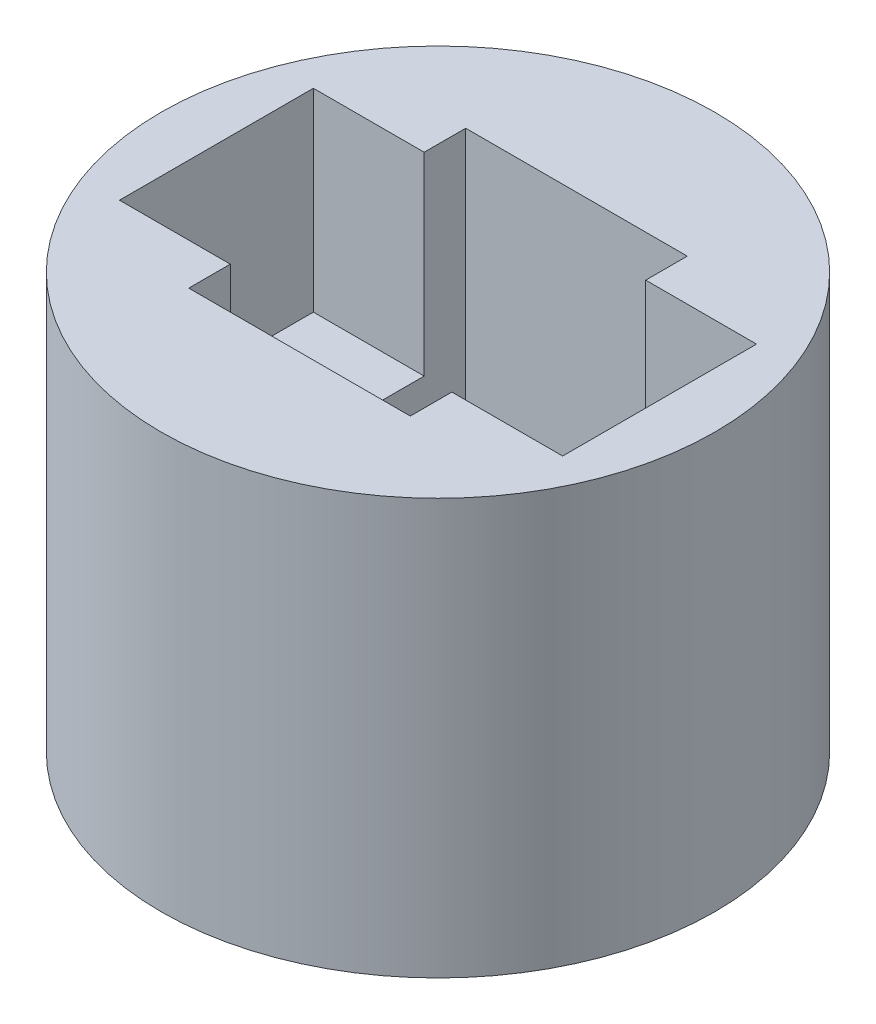
ISO-10303-21;
HEADER;
FILE_DESCRIPTION(('STEP AP214'),'2;1');
FILE_NAME('part.step','',(''),(''),'','','');
FILE_SCHEMA(('AUTOMOTIVE_DESIGN { 1 0 10303 214 1 1 1 1 }'));
ENDSEC;
DATA;
#1=APPLICATION_CONTEXT('core data for automotive mechanical design processes');
#2=APPLICATION_PROTOCOL_DEFINITION('international standard','automotive_design',2000,#1);
#3=PRODUCT_CONTEXT('',#1,'mechanical');
#4=PRODUCT('Part','Part','',(#3));
#5=PRODUCT_RELATED_PRODUCT_CATEGORY('part','',(#4));
#6=PRODUCT_DEFINITION_FORMATION('','',#4);
#7=PRODUCT_DEFINITION_CONTEXT('part definition',#1,'design');
#8=PRODUCT_DEFINITION('design','',#6,#7);
#9=PRODUCT_DEFINITION_SHAPE('','',#8);
#10=(LENGTH_UNIT() NAMED_UNIT(*) SI_UNIT(.MILLI.,.METRE.));
#11=(NAMED_UNIT(*) PLANE_ANGLE_UNIT() SI_UNIT($,.RADIAN.));
#12=(NAMED_UNIT(*) SI_UNIT($,.STERADIAN.) SOLID_ANGLE_UNIT());
#13=UNCERTAINTY_MEASURE_WITH_UNIT(LENGTH_MEASURE(1.E-05),#10,'distance_accuracy_value','');
#14=(GEOMETRIC_REPRESENTATION_CONTEXT(3) GLOBAL_UNCERTAINTY_ASSIGNED_CONTEXT((#13)) GLOBAL_UNIT_ASSIGNED_CONTEXT((#10,
#11,#12)) REPRESENTATION_CONTEXT('',''));
#15=CARTESIAN_POINT('',(0.,0.,0.));
#16=DIRECTION('',(0.,0.,1.));
#17=DIRECTION('',(1.,0.,0.));
#18=AXIS2_PLACEMENT_3D('',#15,#16,#17);
#19=CARTESIAN_POINT('',(0.,7.5,0.));
#20=DIRECTION('',(0.,1.,0.));
#21=DIRECTION('',(-1.,0.,0.));
#22=AXIS2_PLACEMENT_3D('',#19,#20,#21);
#23=PLANE('',#22);
#24=DIRECTION('',(1.,0.,0.));
#25=VECTOR('',#24,1.);
#26=CARTESIAN_POINT('',(-4.,7.5,1.75));
#27=LINE('',#26,#25);
#28=CARTESIAN_POINT('',(2.,7.5,1.75));
#29=VERTEX_POINT('',#28);
#30=CARTESIAN_POINT('',(4.,7.5,1.75));
#31=VERTEX_POINT('',#30);
#32=EDGE_CURVE('E208',#29,#31,#27,.T.);
#33=ORIENTED_EDGE('',*,*,#32,.F.);
#34=DIRECTION('',(0.,0.,-1.));
#35=VECTOR('',#34,1.);
#36=CARTESIAN_POINT('',(2.,7.5,0.));
#37=LINE('',#36,#35);
#38=CARTESIAN_POINT('',(2.,7.5,2.5));
#39=VERTEX_POINT('',#38);
#40=EDGE_CURVE('E323',#39,#29,#37,.T.);
#41=ORIENTED_EDGE('',*,*,#40,.F.);
#42=DIRECTION('',(1.,0.,0.));
#43=VECTOR('',#42,1.);
#44=CARTESIAN_POINT('',(0.,7.5,2.5));
#45=LINE('',#44,#43);
#46=CARTESIAN_POINT('',(-2.,7.5,2.5));
#47=VERTEX_POINT('',#46);
#48=EDGE_CURVE('E319',#47,#39,#45,.T.);
#49=ORIENTED_EDGE('',*,*,#48,.F.);
#50=DIRECTION('',(0.,0.,-1.));
#51=VECTOR('',#50,1.);
#52=CARTESIAN_POINT('',(-2.,7.5,0.));
#53=LINE('',#52,#51);
#54=CARTESIAN_POINT('',(-2.,7.5,1.75));
#55=VERTEX_POINT('',#54);
#56=EDGE_CURVE('E269',#47,#55,#53,.T.);
#57=ORIENTED_EDGE('',*,*,#56,.T.);
#58=CARTESIAN_POINT('',(-4.,7.5,1.75));
#59=VERTEX_POINT('',#58);
#60=EDGE_CURVE('E204',#59,#55,#27,.T.);
#61=ORIENTED_EDGE('',*,*,#60,.F.);
#62=DIRECTION('',(0.,0.,1.));
#63=VECTOR('',#62,1.);
#64=CARTESIAN_POINT('',(-4.,7.5,1.75));
#65=LINE('',#64,#63);
#66=CARTESIAN_POINT('',(-4.,7.5,-1.75));
#67=VERTEX_POINT('',#66);
#68=EDGE_CURVE('E222',#67,#59,#65,.T.);
#69=ORIENTED_EDGE('',*,*,#68,.F.);
#70=DIRECTION('',(-1.,0.,0.));
#71=VECTOR('',#70,1.);
#72=CARTESIAN_POINT('',(-4.,7.5,-1.75));
#73=LINE('',#72,#71);
#74=CARTESIAN_POINT('',(-2.,7.5,-1.75));
#75=VERTEX_POINT('',#74);
#76=EDGE_CURVE('E218',#75,#67,#73,.T.);
#77=ORIENTED_EDGE('',*,*,#76,.F.);
#78=DIRECTION('',(0.,0.,-1.));
#79=VECTOR('',#78,1.);
#80=CARTESIAN_POINT('',(-2.,7.5,0.));
#81=LINE('',#80,#79);
#82=CARTESIAN_POINT('',(-2.,7.5,-2.5));
#83=VERTEX_POINT('',#82);
#84=EDGE_CURVE('E275',#75,#83,#81,.T.);
#85=ORIENTED_EDGE('',*,*,#84,.T.);
#86=DIRECTION('',(1.,0.,0.));
#87=VECTOR('',#86,1.);
#88=CARTESIAN_POINT('',(0.,7.5,-2.5));
#89=LINE('',#88,#87);
#90=CARTESIAN_POINT('',(2.,7.5,-2.5));
#91=VERTEX_POINT('',#90);
#92=EDGE_CURVE('E330',#83,#91,#89,.T.);
#93=ORIENTED_EDGE('',*,*,#92,.T.);
#94=DIRECTION('',(0.,0.,-1.));
#95=VECTOR('',#94,1.);
#96=CARTESIAN_POINT('',(2.,7.5,0.));
#97=LINE('',#96,#95);
#98=CARTESIAN_POINT('',(2.,7.5,-1.75));
#99=VERTEX_POINT('',#98);
#100=EDGE_CURVE('E327',#99,#91,#97,.T.);
#101=ORIENTED_EDGE('',*,*,#100,.F.);
#102=CARTESIAN_POINT('',(4.,7.5,-1.75));
#103=VERTEX_POINT('',#102);
#104=EDGE_CURVE('E219',#103,#99,#73,.T.);
#105=ORIENTED_EDGE('',*,*,#104,.F.);
#106=DIRECTION('',(0.,0.,-1.));
#107=VECTOR('',#106,1.);
#108=CARTESIAN_POINT('',(4.,7.5,1.75));
#109=LINE('',#108,#107);
#110=EDGE_CURVE('E184',#31,#103,#109,.T.);
#111=ORIENTED_EDGE('',*,*,#110,.F.);
#112=EDGE_LOOP('',(#33,#41,#49,#57,#61,#69,#77,#85,#93,#101,#105,#111));
#113=FACE_BOUND('',#112,.T.);
#114=CARTESIAN_POINT('',(0.,7.5,0.));
#115=DIRECTION('',(0.,-1.,0.));
#116=DIRECTION('',(1.,0.,0.));
#117=AXIS2_PLACEMENT_3D('',#114,#115,#116);
#118=CIRCLE('',#117,5.);
#119=CARTESIAN_POINT('',(5.,7.5,0.));
#120=VERTEX_POINT('',#119);
#121=EDGE_CURVE('E385',#120,#120,#118,.T.);
#122=ORIENTED_EDGE('',*,*,#121,.F.);
#123=EDGE_LOOP('',(#122));
#124=FACE_BOUND('',#123,.T.);
#125=ADVANCED_FACE('F39',(#113,#124),#23,.T.);
#126=CARTESIAN_POINT('',(0.,0.,0.));
#127=DIRECTION('',(0.,-1.,0.));
#128=DIRECTION('',(1.,0.,0.));
#129=AXIS2_PLACEMENT_3D('',#126,#127,#128);
#130=CYLINDRICAL_SURFACE('',#129,5.);
#131=ORIENTED_EDGE('',*,*,#121,.T.);
#132=EDGE_LOOP('',(#131));
#133=FACE_BOUND('',#132,.T.);
#134=CARTESIAN_POINT('',(0.,0.,0.));
#135=DIRECTION('',(0.,-1.,0.));
#136=DIRECTION('',(1.,0.,0.));
#137=AXIS2_PLACEMENT_3D('',#134,#135,#136);
#138=CIRCLE('',#137,5.);
#139=CARTESIAN_POINT('',(5.,0.,0.));
#140=VERTEX_POINT('',#139);
#141=EDGE_CURVE('E340',#140,#140,#138,.T.);
#142=ORIENTED_EDGE('',*,*,#141,.F.);
#143=EDGE_LOOP('',(#142));
#144=FACE_BOUND('',#143,.T.);
#145=ADVANCED_FACE('F475',(#133,#144),#130,.T.);
#146=CARTESIAN_POINT('',(0.,0.,0.));
#147=DIRECTION('',(0.,-1.,0.));
#148=DIRECTION('',(1.,0.,0.));
#149=AXIS2_PLACEMENT_3D('',#146,#147,#148);
#150=PLANE('',#149);
#151=CARTESIAN_POINT('',(-3.,0.,0.));
#152=DIRECTION('',(0.,1.,0.));
#153=DIRECTION('',(-1.,0.,0.));
#154=AXIS2_PLACEMENT_3D('',#151,#152,#153);
#155=CIRCLE('',#154,0.499999999999999);
#156=CARTESIAN_POINT('',(-3.,0.,-0.500000000000018));
#157=VERTEX_POINT('',#156);
#158=CARTESIAN_POINT('',(-3.,0.,0.499999999999982));
#159=VERTEX_POINT('',#158);
#160=EDGE_CURVE('E270',#157,#159,#155,.T.);
#161=ORIENTED_EDGE('',*,*,#160,.T.);
#162=DIRECTION('',(1.,0.,0.));
#163=VECTOR('',#162,1.);
#164=CARTESIAN_POINT('',(0.,0.,0.499999999999983));
#165=LINE('',#164,#163);
#166=CARTESIAN_POINT('',(-2.,0.,0.499999999999982));
#167=VERTEX_POINT('',#166);
#168=EDGE_CURVE('E274',#159,#167,#165,.T.);
#169=ORIENTED_EDGE('',*,*,#168,.T.);
#170=DIRECTION('',(0.,0.,-1.));
#171=VECTOR('',#170,1.);
#172=CARTESIAN_POINT('',(-2.,0.,0.));
#173=LINE('',#172,#171);
#174=CARTESIAN_POINT('',(-2.,0.,2.5));
#175=VERTEX_POINT('',#174);
#176=EDGE_CURVE('E279',#175,#167,#173,.T.);
#177=ORIENTED_EDGE('',*,*,#176,.F.);
#178=DIRECTION('',(1.,0.,0.));
#179=VECTOR('',#178,1.);
#180=CARTESIAN_POINT('',(0.,0.,2.5));
#181=LINE('',#180,#179);
#182=CARTESIAN_POINT('',(2.,0.,2.5));
#183=VERTEX_POINT('',#182);
#184=EDGE_CURVE('E283',#175,#183,#181,.T.);
#185=ORIENTED_EDGE('',*,*,#184,.T.);
#186=DIRECTION('',(0.,0.,-1.));
#187=VECTOR('',#186,1.);
#188=CARTESIAN_POINT('',(2.,0.,0.));
#189=LINE('',#188,#187);
#190=CARTESIAN_POINT('',(2.,0.,0.499999999999983));
#191=VERTEX_POINT('',#190);
#192=EDGE_CURVE('E287',#183,#191,#189,.T.);
#193=ORIENTED_EDGE('',*,*,#192,.T.);
#194=DIRECTION('',(1.,0.,0.));
#195=VECTOR('',#194,1.);
#196=CARTESIAN_POINT('',(0.,0.,0.499999999999983));
#197=LINE('',#196,#195);
#198=CARTESIAN_POINT('',(3.,0.,0.499999999999985));
#199=VERTEX_POINT('',#198);
#200=EDGE_CURVE('E291',#191,#199,#197,.T.);
#201=ORIENTED_EDGE('',*,*,#200,.T.);
#202=CARTESIAN_POINT('',(3.,0.,0.));
#203=DIRECTION('',(0.,1.,0.));
#204=DIRECTION('',(-1.,0.,0.));
#205=AXIS2_PLACEMENT_3D('',#202,#203,#204);
#206=CIRCLE('',#205,0.5);
#207=CARTESIAN_POINT('',(3.,0.,-0.500000000000015));
#208=VERTEX_POINT('',#207);
#209=EDGE_CURVE('E295',#199,#208,#206,.T.);
#210=ORIENTED_EDGE('',*,*,#209,.T.);
#211=DIRECTION('',(1.,0.,0.));
#212=VECTOR('',#211,1.);
#213=CARTESIAN_POINT('',(0.,0.,-0.500000000000017));
#214=LINE('',#213,#212);
#215=CARTESIAN_POINT('',(2.,0.,-0.500000000000016));
#216=VERTEX_POINT('',#215);
#217=EDGE_CURVE('E299',#216,#208,#214,.T.);
#218=ORIENTED_EDGE('',*,*,#217,.F.);
#219=DIRECTION('',(0.,0.,-1.));
#220=VECTOR('',#219,1.);
#221=CARTESIAN_POINT('',(2.,0.,0.));
#222=LINE('',#221,#220);
#223=CARTESIAN_POINT('',(2.,0.,-2.5));
#224=VERTEX_POINT('',#223);
#225=EDGE_CURVE('E302',#216,#224,#222,.T.);
#226=ORIENTED_EDGE('',*,*,#225,.T.);
#227=DIRECTION('',(1.,0.,0.));
#228=VECTOR('',#227,1.);
#229=CARTESIAN_POINT('',(0.,0.,-2.5));
#230=LINE('',#229,#228);
#231=CARTESIAN_POINT('',(-2.,0.,-2.5));
#232=VERTEX_POINT('',#231);
#233=EDGE_CURVE('E306',#232,#224,#230,.T.);
#234=ORIENTED_EDGE('',*,*,#233,.F.);
#235=DIRECTION('',(0.,0.,-1.));
#236=VECTOR('',#235,1.);
#237=CARTESIAN_POINT('',(-2.,0.,0.));
#238=LINE('',#237,#236);
#239=CARTESIAN_POINT('',(-2.,0.,-0.500000000000018));
#240=VERTEX_POINT('',#239);
#241=EDGE_CURVE('E309',#240,#232,#238,.T.);
#242=ORIENTED_EDGE('',*,*,#241,.F.);
#243=DIRECTION('',(1.,0.,0.));
#244=VECTOR('',#243,1.);
#245=CARTESIAN_POINT('',(0.,0.,-0.500000000000017));
#246=LINE('',#245,#244);
#247=EDGE_CURVE('E312',#157,#240,#246,.T.);
#248=ORIENTED_EDGE('',*,*,#247,.F.);
#249=EDGE_LOOP('',(#161,#169,#177,#185,#193,#201,#210,#218,#226,#234,#242,#248));
#250=FACE_BOUND('',#249,.T.);
#251=ORIENTED_EDGE('',*,*,#141,.T.);
#252=EDGE_LOOP('',(#251));
#253=FACE_BOUND('',#252,.T.);
#254=ADVANCED_FACE('F448',(#250,#253),#150,.T.);
#255=CARTESIAN_POINT('',(-3.,0.,0.));
#256=DIRECTION('',(0.,1.,0.));
#257=DIRECTION('',(-1.,0.,0.));
#258=AXIS2_PLACEMENT_3D('',#255,#256,#257);
#259=CYLINDRICAL_SURFACE('',#258,0.499999999999999);
#260=DIRECTION('',(0.,1.,0.));
#261=VECTOR('',#260,1.);
#262=CARTESIAN_POINT('',(-3.,0.,-0.500000000000018));
#263=LINE('',#262,#261);
#264=CARTESIAN_POINT('',(-3.,4.,-0.500000000000017));
#265=VERTEX_POINT('',#264);
#266=EDGE_CURVE('E336',#157,#265,#263,.T.);
#267=ORIENTED_EDGE('',*,*,#266,.T.);
#268=CARTESIAN_POINT('',(-3.,4.,0.));
#269=DIRECTION('',(0.,-1.,0.));
#270=DIRECTION('',(1.,0.,0.));
#271=AXIS2_PLACEMENT_3D('',#268,#269,#270);
#272=CIRCLE('',#271,0.499999999999999);
#273=CARTESIAN_POINT('',(-3.,4.,0.499999999999982));
#274=VERTEX_POINT('',#273);
#275=EDGE_CURVE('E237',#265,#274,#272,.F.);
#276=ORIENTED_EDGE('',*,*,#275,.T.);
#277=DIRECTION('',(0.,1.,0.));
#278=VECTOR('',#277,1.);
#279=CARTESIAN_POINT('',(-3.,0.,0.499999999999982));
#280=LINE('',#279,#278);
#281=EDGE_CURVE('E315',#159,#274,#280,.T.);
#282=ORIENTED_EDGE('',*,*,#281,.F.);
#283=ORIENTED_EDGE('',*,*,#160,.F.);
#284=EDGE_LOOP('',(#267,#276,#282,#283));
#285=FACE_BOUND('',#284,.T.);
#286=ADVANCED_FACE('F408',(#285),#259,.F.);
#287=CARTESIAN_POINT('',(0.,0.,-0.500000000000017));
#288=DIRECTION('',(0.,0.,1.));
#289=DIRECTION('',(1.,0.,0.));
#290=AXIS2_PLACEMENT_3D('',#287,#288,#289);
#291=PLANE('',#290);
#292=DIRECTION('',(1.,0.,0.));
#293=VECTOR('',#292,1.);
#294=CARTESIAN_POINT('',(0.,4.,-0.500000000000017));
#295=LINE('',#294,#293);
#296=CARTESIAN_POINT('',(-2.,4.,-0.500000000000018));
#297=VERTEX_POINT('',#296);
#298=EDGE_CURVE('E241',#265,#297,#295,.T.);
#299=ORIENTED_EDGE('',*,*,#298,.F.);
#300=ORIENTED_EDGE('',*,*,#266,.F.);
#301=ORIENTED_EDGE('',*,*,#247,.T.);
#302=DIRECTION('',(0.,1.,0.));
#303=VECTOR('',#302,1.);
#304=CARTESIAN_POINT('',(-2.,0.,-0.500000000000018));
#305=LINE('',#304,#303);
#306=EDGE_CURVE('E341',#240,#297,#305,.T.);
#307=ORIENTED_EDGE('',*,*,#306,.T.);
#308=EDGE_LOOP('',(#299,#300,#301,#307));
#309=FACE_BOUND('',#308,.T.);
#310=ADVANCED_FACE('F412',(#309),#291,.T.);
#311=CARTESIAN_POINT('',(-2.,0.,0.));
#312=DIRECTION('',(1.,0.,0.));
#313=DIRECTION('',(0.,1.,0.));
#314=AXIS2_PLACEMENT_3D('',#311,#312,#313);
#315=PLANE('',#314);
#316=DIRECTION('',(0.,1.,0.));
#317=VECTOR('',#316,1.);
#318=CARTESIAN_POINT('',(-2.,0.,-1.75));
#319=LINE('',#318,#317);
#320=CARTESIAN_POINT('',(-2.,4.,-1.75));
#321=VERTEX_POINT('',#320);
#322=EDGE_CURVE('E266',#321,#75,#319,.T.);
#323=ORIENTED_EDGE('',*,*,#322,.F.);
#324=DIRECTION('',(0.,0.,-1.));
#325=VECTOR('',#324,1.);
#326=CARTESIAN_POINT('',(-2.,4.,0.));
#327=LINE('',#326,#325);
#328=EDGE_CURVE('E244',#297,#321,#327,.T.);
#329=ORIENTED_EDGE('',*,*,#328,.F.);
#330=ORIENTED_EDGE('',*,*,#306,.F.);
#331=ORIENTED_EDGE('',*,*,#241,.T.);
#332=DIRECTION('',(0.,1.,0.));
#333=VECTOR('',#332,1.);
#334=CARTESIAN_POINT('',(-2.,0.,-2.5));
#335=LINE('',#334,#333);
#336=EDGE_CURVE('E345',#232,#83,#335,.T.);
#337=ORIENTED_EDGE('',*,*,#336,.T.);
#338=ORIENTED_EDGE('',*,*,#84,.F.);
#339=EDGE_LOOP('',(#323,#329,#330,#331,#337,#338));
#340=FACE_BOUND('',#339,.T.);
#341=ADVANCED_FACE('F418',(#340),#315,.T.);
#342=CARTESIAN_POINT('',(0.,0.,-2.5));
#343=DIRECTION('',(0.,0.,1.));
#344=DIRECTION('',(1.,0.,0.));
#345=AXIS2_PLACEMENT_3D('',#342,#343,#344);
#346=PLANE('',#345);
#347=ORIENTED_EDGE('',*,*,#92,.F.);
#348=ORIENTED_EDGE('',*,*,#336,.F.);
#349=ORIENTED_EDGE('',*,*,#233,.T.);
#350=DIRECTION('',(0.,1.,0.));
#351=VECTOR('',#350,1.);
#352=CARTESIAN_POINT('',(2.,0.,-2.5));
#353=LINE('',#352,#351);
#354=EDGE_CURVE('E349',#224,#91,#353,.T.);
#355=ORIENTED_EDGE('',*,*,#354,.T.);
#356=EDGE_LOOP('',(#347,#348,#349,#355));
#357=FACE_BOUND('',#356,.T.);
#358=ADVANCED_FACE('F465',(#357),#346,.T.);
#359=CARTESIAN_POINT('',(2.,0.,0.));
#360=DIRECTION('',(1.,0.,0.));
#361=DIRECTION('',(0.,1.,0.));
#362=AXIS2_PLACEMENT_3D('',#359,#360,#361);
#363=PLANE('',#362);
#364=DIRECTION('',(0.,0.,-1.));
#365=VECTOR('',#364,1.);
#366=CARTESIAN_POINT('',(2.,4.,0.));
#367=LINE('',#366,#365);
#368=CARTESIAN_POINT('',(2.,4.,-0.500000000000016));
#369=VERTEX_POINT('',#368);
#370=CARTESIAN_POINT('',(2.,4.,-1.75));
#371=VERTEX_POINT('',#370);
#372=EDGE_CURVE('E259',#369,#371,#367,.T.);
#373=ORIENTED_EDGE('',*,*,#372,.T.);
#374=DIRECTION('',(0.,1.,0.));
#375=VECTOR('',#374,1.);
#376=CARTESIAN_POINT('',(2.,0.,-1.75));
#377=LINE('',#376,#375);
#378=EDGE_CURVE('E11',#371,#99,#377,.T.);
#379=ORIENTED_EDGE('',*,*,#378,.T.);
#380=ORIENTED_EDGE('',*,*,#100,.T.);
#381=ORIENTED_EDGE('',*,*,#354,.F.);
#382=ORIENTED_EDGE('',*,*,#225,.F.);
#383=DIRECTION('',(0.,1.,0.));
#384=VECTOR('',#383,1.);
#385=CARTESIAN_POINT('',(2.,0.,-0.500000000000016));
#386=LINE('',#385,#384);
#387=EDGE_CURVE('E353',#216,#369,#386,.T.);
#388=ORIENTED_EDGE('',*,*,#387,.T.);
#389=EDGE_LOOP('',(#373,#379,#380,#381,#382,#388));
#390=FACE_BOUND('',#389,.T.);
#391=ADVANCED_FACE('F436',(#390),#363,.F.);
#392=CARTESIAN_POINT('',(0.,0.,-0.500000000000017));
#393=DIRECTION('',(0.,0.,1.));
#394=DIRECTION('',(1.,0.,0.));
#395=AXIS2_PLACEMENT_3D('',#392,#393,#394);
#396=PLANE('',#395);
#397=DIRECTION('',(1.,0.,0.));
#398=VECTOR('',#397,1.);
#399=CARTESIAN_POINT('',(0.,4.,-0.500000000000017));
#400=LINE('',#399,#398);
#401=CARTESIAN_POINT('',(3.,4.,-0.500000000000015));
#402=VERTEX_POINT('',#401);
#403=EDGE_CURVE('E256',#369,#402,#400,.T.);
#404=ORIENTED_EDGE('',*,*,#403,.F.);
#405=ORIENTED_EDGE('',*,*,#387,.F.);
#406=ORIENTED_EDGE('',*,*,#217,.T.);
#407=DIRECTION('',(0.,1.,0.));
#408=VECTOR('',#407,1.);
#409=CARTESIAN_POINT('',(3.,0.,-0.500000000000015));
#410=LINE('',#409,#408);
#411=EDGE_CURVE('E357',#208,#402,#410,.T.);
#412=ORIENTED_EDGE('',*,*,#411,.T.);
#413=EDGE_LOOP('',(#404,#405,#406,#412));
#414=FACE_BOUND('',#413,.T.);
#415=ADVANCED_FACE('F441',(#414),#396,.T.);
#416=CARTESIAN_POINT('',(3.,0.,0.));
#417=DIRECTION('',(0.,1.,0.));
#418=DIRECTION('',(-1.,0.,0.));
#419=AXIS2_PLACEMENT_3D('',#416,#417,#418);
#420=CYLINDRICAL_SURFACE('',#419,0.5);
#421=DIRECTION('',(0.,1.,0.));
#422=VECTOR('',#421,1.);
#423=CARTESIAN_POINT('',(3.,0.,0.499999999999985));
#424=LINE('',#423,#422);
#425=CARTESIAN_POINT('',(3.,4.,0.499999999999985));
#426=VERTEX_POINT('',#425);
#427=EDGE_CURVE('E361',#199,#426,#424,.T.);
#428=ORIENTED_EDGE('',*,*,#427,.T.);
#429=CARTESIAN_POINT('',(3.,4.,0.));
#430=DIRECTION('',(0.,-1.,0.));
#431=DIRECTION('',(1.,0.,0.));
#432=AXIS2_PLACEMENT_3D('',#429,#430,#431);
#433=CIRCLE('',#432,0.5);
#434=EDGE_CURVE('E252',#426,#402,#433,.F.);
#435=ORIENTED_EDGE('',*,*,#434,.T.);
#436=ORIENTED_EDGE('',*,*,#411,.F.);
#437=ORIENTED_EDGE('',*,*,#209,.F.);
#438=EDGE_LOOP('',(#428,#435,#436,#437));
#439=FACE_BOUND('',#438,.T.);
#440=ADVANCED_FACE('F446',(#439),#420,.F.);
#441=CARTESIAN_POINT('',(0.,0.,0.499999999999983));
#442=DIRECTION('',(0.,0.,1.));
#443=DIRECTION('',(1.,0.,0.));
#444=AXIS2_PLACEMENT_3D('',#441,#442,#443);
#445=PLANE('',#444);
#446=DIRECTION('',(0.,1.,0.));
#447=VECTOR('',#446,1.);
#448=CARTESIAN_POINT('',(2.,0.,0.499999999999983));
#449=LINE('',#448,#447);
#450=CARTESIAN_POINT('',(2.,4.,0.499999999999983));
#451=VERTEX_POINT('',#450);
#452=EDGE_CURVE('E365',#191,#451,#449,.T.);
#453=ORIENTED_EDGE('',*,*,#452,.T.);
#454=DIRECTION('',(1.,0.,0.));
#455=VECTOR('',#454,1.);
#456=CARTESIAN_POINT('',(0.,4.,0.499999999999983));
#457=LINE('',#456,#455);
#458=EDGE_CURVE('E54',#451,#426,#457,.T.);
#459=ORIENTED_EDGE('',*,*,#458,.T.);
#460=ORIENTED_EDGE('',*,*,#427,.F.);
#461=ORIENTED_EDGE('',*,*,#200,.F.);
#462=EDGE_LOOP('',(#453,#459,#460,#461));
#463=FACE_BOUND('',#462,.T.);
#464=ADVANCED_FACE('F453',(#463),#445,.F.);
#465=CARTESIAN_POINT('',(2.,0.,0.));
#466=DIRECTION('',(1.,0.,0.));
#467=DIRECTION('',(0.,1.,0.));
#468=AXIS2_PLACEMENT_3D('',#465,#466,#467);
#469=PLANE('',#468);
#470=ORIENTED_EDGE('',*,*,#40,.T.);
#471=DIRECTION('',(0.,-1.,0.));
#472=VECTOR('',#471,1.);
#473=CARTESIAN_POINT('',(2.,0.,1.75));
#474=LINE('',#473,#472);
#475=CARTESIAN_POINT('',(2.,4.,1.75));
#476=VERTEX_POINT('',#475);
#477=EDGE_CURVE('E262',#29,#476,#474,.T.);
#478=ORIENTED_EDGE('',*,*,#477,.T.);
#479=DIRECTION('',(0.,0.,-1.));
#480=VECTOR('',#479,1.);
#481=CARTESIAN_POINT('',(2.,4.,0.));
#482=LINE('',#481,#480);
#483=EDGE_CURVE('E247',#476,#451,#482,.T.);
#484=ORIENTED_EDGE('',*,*,#483,.T.);
#485=ORIENTED_EDGE('',*,*,#452,.F.);
#486=ORIENTED_EDGE('',*,*,#192,.F.);
#487=DIRECTION('',(0.,1.,0.));
#488=VECTOR('',#487,1.);
#489=CARTESIAN_POINT('',(2.,0.,2.5));
#490=LINE('',#489,#488);
#491=EDGE_CURVE('E369',#183,#39,#490,.T.);
#492=ORIENTED_EDGE('',*,*,#491,.T.);
#493=EDGE_LOOP('',(#470,#478,#484,#485,#486,#492));
#494=FACE_BOUND('',#493,.T.);
#495=ADVANCED_FACE('F455',(#494),#469,.F.);
#496=CARTESIAN_POINT('',(0.,0.,2.5));
#497=DIRECTION('',(0.,0.,1.));
#498=DIRECTION('',(1.,0.,0.));
#499=AXIS2_PLACEMENT_3D('',#496,#497,#498);
#500=PLANE('',#499);
#501=ORIENTED_EDGE('',*,*,#48,.T.);
#502=ORIENTED_EDGE('',*,*,#491,.F.);
#503=ORIENTED_EDGE('',*,*,#184,.F.);
#504=DIRECTION('',(0.,1.,0.));
#505=VECTOR('',#504,1.);
#506=CARTESIAN_POINT('',(-2.,0.,2.5));
#507=LINE('',#506,#505);
#508=EDGE_CURVE('E372',#175,#47,#507,.T.);
#509=ORIENTED_EDGE('',*,*,#508,.T.);
#510=EDGE_LOOP('',(#501,#502,#503,#509));
#511=FACE_BOUND('',#510,.T.);
#512=ADVANCED_FACE('F459',(#511),#500,.F.);
#513=CARTESIAN_POINT('',(-2.,0.,0.));
#514=DIRECTION('',(1.,0.,0.));
#515=DIRECTION('',(0.,1.,0.));
#516=AXIS2_PLACEMENT_3D('',#513,#514,#515);
#517=PLANE('',#516);
#518=DIRECTION('',(0.,-1.,0.));
#519=VECTOR('',#518,1.);
#520=CARTESIAN_POINT('',(-2.,0.,1.75));
#521=LINE('',#520,#519);
#522=CARTESIAN_POINT('',(-2.,4.,1.75));
#523=VERTEX_POINT('',#522);
#524=EDGE_CURVE('E47',#55,#523,#521,.T.);
#525=ORIENTED_EDGE('',*,*,#524,.F.);
#526=ORIENTED_EDGE('',*,*,#56,.F.);
#527=ORIENTED_EDGE('',*,*,#508,.F.);
#528=ORIENTED_EDGE('',*,*,#176,.T.);
#529=DIRECTION('',(0.,1.,0.));
#530=VECTOR('',#529,1.);
#531=CARTESIAN_POINT('',(-2.,0.,0.499999999999983));
#532=LINE('',#531,#530);
#533=CARTESIAN_POINT('',(-2.,4.,0.499999999999983));
#534=VERTEX_POINT('',#533);
#535=EDGE_CURVE('E375',#167,#534,#532,.T.);
#536=ORIENTED_EDGE('',*,*,#535,.T.);
#537=DIRECTION('',(0.,0.,-1.));
#538=VECTOR('',#537,1.);
#539=CARTESIAN_POINT('',(-2.,4.,0.));
#540=LINE('',#539,#538);
#541=EDGE_CURVE('E62',#523,#534,#540,.T.);
#542=ORIENTED_EDGE('',*,*,#541,.F.);
#543=EDGE_LOOP('',(#525,#526,#527,#528,#536,#542));
#544=FACE_BOUND('',#543,.T.);
#545=ADVANCED_FACE('F401',(#544),#517,.T.);
#546=CARTESIAN_POINT('',(0.,0.,0.499999999999983));
#547=DIRECTION('',(0.,0.,1.));
#548=DIRECTION('',(1.,0.,0.));
#549=AXIS2_PLACEMENT_3D('',#546,#547,#548);
#550=PLANE('',#549);
#551=ORIENTED_EDGE('',*,*,#281,.T.);
#552=DIRECTION('',(1.,0.,0.));
#553=VECTOR('',#552,1.);
#554=CARTESIAN_POINT('',(0.,4.,0.499999999999983));
#555=LINE('',#554,#553);
#556=EDGE_CURVE('E389',#274,#534,#555,.T.);
#557=ORIENTED_EDGE('',*,*,#556,.T.);
#558=ORIENTED_EDGE('',*,*,#535,.F.);
#559=ORIENTED_EDGE('',*,*,#168,.F.);
#560=EDGE_LOOP('',(#551,#557,#558,#559));
#561=FACE_BOUND('',#560,.T.);
#562=ADVANCED_FACE('F405',(#561),#550,.F.);
#563=CARTESIAN_POINT('',(0.,4.,0.));
#564=DIRECTION('',(0.,-1.,0.));
#565=DIRECTION('',(1.,0.,0.));
#566=AXIS2_PLACEMENT_3D('',#563,#564,#565);
#567=PLANE('',#566);
#568=ORIENTED_EDGE('',*,*,#328,.T.);
#569=DIRECTION('',(-1.,0.,0.));
#570=VECTOR('',#569,1.);
#571=CARTESIAN_POINT('',(-4.,4.,-1.75));
#572=LINE('',#571,#570);
#573=CARTESIAN_POINT('',(-4.,4.,-1.75));
#574=VERTEX_POINT('',#573);
#575=EDGE_CURVE('E197',#321,#574,#572,.T.);
#576=ORIENTED_EDGE('',*,*,#575,.T.);
#577=DIRECTION('',(0.,0.,1.));
#578=VECTOR('',#577,1.);
#579=CARTESIAN_POINT('',(-4.,4.,1.75));
#580=LINE('',#579,#578);
#581=CARTESIAN_POINT('',(-4.,4.,1.75));
#582=VERTEX_POINT('',#581);
#583=EDGE_CURVE('E196',#574,#582,#580,.T.);
#584=ORIENTED_EDGE('',*,*,#583,.T.);
#585=DIRECTION('',(1.,0.,0.));
#586=VECTOR('',#585,1.);
#587=CARTESIAN_POINT('',(-4.,4.,1.75));
#588=LINE('',#587,#586);
#589=EDGE_CURVE('E189',#582,#523,#588,.T.);
#590=ORIENTED_EDGE('',*,*,#589,.T.);
#591=ORIENTED_EDGE('',*,*,#541,.T.);
#592=ORIENTED_EDGE('',*,*,#556,.F.);
#593=ORIENTED_EDGE('',*,*,#275,.F.);
#594=ORIENTED_EDGE('',*,*,#298,.T.);
#595=EDGE_LOOP('',(#568,#576,#584,#590,#591,#592,#593,#594));
#596=FACE_BOUND('',#595,.T.);
#597=ADVANCED_FACE('F399',(#596),#567,.F.);
#598=CARTESIAN_POINT('',(-4.,4.,1.75));
#599=DIRECTION('',(0.,0.,1.));
#600=DIRECTION('',(1.,0.,0.));
#601=AXIS2_PLACEMENT_3D('',#598,#599,#600);
#602=PLANE('',#601);
#603=ORIENTED_EDGE('',*,*,#524,.T.);
#604=ORIENTED_EDGE('',*,*,#589,.F.);
#605=DIRECTION('',(0.,1.,0.));
#606=VECTOR('',#605,1.);
#607=CARTESIAN_POINT('',(-4.,4.,1.75));
#608=LINE('',#607,#606);
#609=EDGE_CURVE('E229',#582,#59,#608,.T.);
#610=ORIENTED_EDGE('',*,*,#609,.T.);
#611=ORIENTED_EDGE('',*,*,#60,.T.);
#612=EDGE_LOOP('',(#603,#604,#610,#611));
#613=FACE_BOUND('',#612,.T.);
#614=ADVANCED_FACE('F395',(#613),#602,.F.);
#615=CARTESIAN_POINT('',(-4.,4.,-1.75));
#616=DIRECTION('',(0.,0.,-1.));
#617=DIRECTION('',(-1.,0.,0.));
#618=AXIS2_PLACEMENT_3D('',#615,#616,#617);
#619=PLANE('',#618);
#620=ORIENTED_EDGE('',*,*,#322,.T.);
#621=ORIENTED_EDGE('',*,*,#76,.T.);
#622=DIRECTION('',(0.,1.,0.));
#623=VECTOR('',#622,1.);
#624=CARTESIAN_POINT('',(-4.,4.,-1.75));
#625=LINE('',#624,#623);
#626=EDGE_CURVE('E188',#574,#67,#625,.T.);
#627=ORIENTED_EDGE('',*,*,#626,.F.);
#628=ORIENTED_EDGE('',*,*,#575,.F.);
#629=EDGE_LOOP('',(#620,#621,#627,#628));
#630=FACE_BOUND('',#629,.T.);
#631=ADVANCED_FACE('F423',(#630),#619,.F.);
#632=CARTESIAN_POINT('',(-4.,4.,1.75));
#633=DIRECTION('',(-1.,0.,0.));
#634=DIRECTION('',(0.,-1.,0.));
#635=AXIS2_PLACEMENT_3D('',#632,#633,#634);
#636=PLANE('',#635);
#637=ORIENTED_EDGE('',*,*,#68,.T.);
#638=ORIENTED_EDGE('',*,*,#609,.F.);
#639=ORIENTED_EDGE('',*,*,#583,.F.);
#640=ORIENTED_EDGE('',*,*,#626,.T.);
#641=EDGE_LOOP('',(#637,#638,#639,#640));
#642=FACE_BOUND('',#641,.T.);
#643=ADVANCED_FACE('F547',(#642),#636,.F.);
#644=CARTESIAN_POINT('',(4.,4.,-1.75));
#645=VERTEX_POINT('',#644);
#646=EDGE_CURVE('E192',#645,#371,#572,.T.);
#647=ORIENTED_EDGE('',*,*,#646,.F.);
#648=DIRECTION('',(0.,1.,0.));
#649=VECTOR('',#648,1.);
#650=CARTESIAN_POINT('',(4.,4.,-1.75));
#651=LINE('',#650,#649);
#652=EDGE_CURVE('E177',#645,#103,#651,.T.);
#653=ORIENTED_EDGE('',*,*,#652,.T.);
#654=ORIENTED_EDGE('',*,*,#104,.T.);
#655=ORIENTED_EDGE('',*,*,#378,.F.);
#656=EDGE_LOOP('',(#647,#653,#654,#655));
#657=FACE_BOUND('',#656,.T.);
#658=ADVANCED_FACE('F193',(#657),#619,.F.);
#659=ORIENTED_EDGE('',*,*,#32,.T.);
#660=DIRECTION('',(0.,1.,0.));
#661=VECTOR('',#660,1.);
#662=CARTESIAN_POINT('',(4.,4.,1.75));
#663=LINE('',#662,#661);
#664=CARTESIAN_POINT('',(4.,4.,1.75));
#665=VERTEX_POINT('',#664);
#666=EDGE_CURVE('E226',#665,#31,#663,.T.);
#667=ORIENTED_EDGE('',*,*,#666,.F.);
#668=EDGE_CURVE('E201',#476,#665,#588,.T.);
#669=ORIENTED_EDGE('',*,*,#668,.F.);
#670=ORIENTED_EDGE('',*,*,#477,.F.);
#671=EDGE_LOOP('',(#659,#667,#669,#670));
#672=FACE_BOUND('',#671,.T.);
#673=ADVANCED_FACE('F432',(#672),#602,.F.);
#674=ORIENTED_EDGE('',*,*,#403,.T.);
#675=ORIENTED_EDGE('',*,*,#434,.F.);
#676=ORIENTED_EDGE('',*,*,#458,.F.);
#677=ORIENTED_EDGE('',*,*,#483,.F.);
#678=ORIENTED_EDGE('',*,*,#668,.T.);
#679=DIRECTION('',(0.,0.,-1.));
#680=VECTOR('',#679,1.);
#681=CARTESIAN_POINT('',(4.,4.,1.75));
#682=LINE('',#681,#680);
#683=EDGE_CURVE('E182',#665,#645,#682,.T.);
#684=ORIENTED_EDGE('',*,*,#683,.T.);
#685=ORIENTED_EDGE('',*,*,#646,.T.);
#686=ORIENTED_EDGE('',*,*,#372,.F.);
#687=EDGE_LOOP('',(#674,#675,#676,#677,#678,#684,#685,#686));
#688=FACE_BOUND('',#687,.T.);
#689=ADVANCED_FACE('F199',(#688),#567,.F.);
#690=CARTESIAN_POINT('',(4.,4.,1.75));
#691=DIRECTION('',(1.,0.,0.));
#692=DIRECTION('',(0.,1.,0.));
#693=AXIS2_PLACEMENT_3D('',#690,#691,#692);
#694=PLANE('',#693);
#695=ORIENTED_EDGE('',*,*,#110,.T.);
#696=ORIENTED_EDGE('',*,*,#652,.F.);
#697=ORIENTED_EDGE('',*,*,#683,.F.);
#698=ORIENTED_EDGE('',*,*,#666,.T.);
#699=EDGE_LOOP('',(#695,#696,#697,#698));
#700=FACE_BOUND('',#699,.T.);
#701=ADVANCED_FACE('F179',(#700),#694,.F.);
#702=CLOSED_SHELL('',(#125,#145,#254,#286,#310,#341,#358,#391,#415,#440,#464,#495,#512,#545,
#562,#597,#614,#631,#643,#658,#673,#689,#701));
#703=MANIFOLD_SOLID_BREP('B2',#702);
#704=ADVANCED_BREP_SHAPE_REPRESENTATION('',(#18,#703),#14);
#705=SHAPE_DEFINITION_REPRESENTATION(#9,#704);
ENDSEC;
END-ISO-10303-21;
